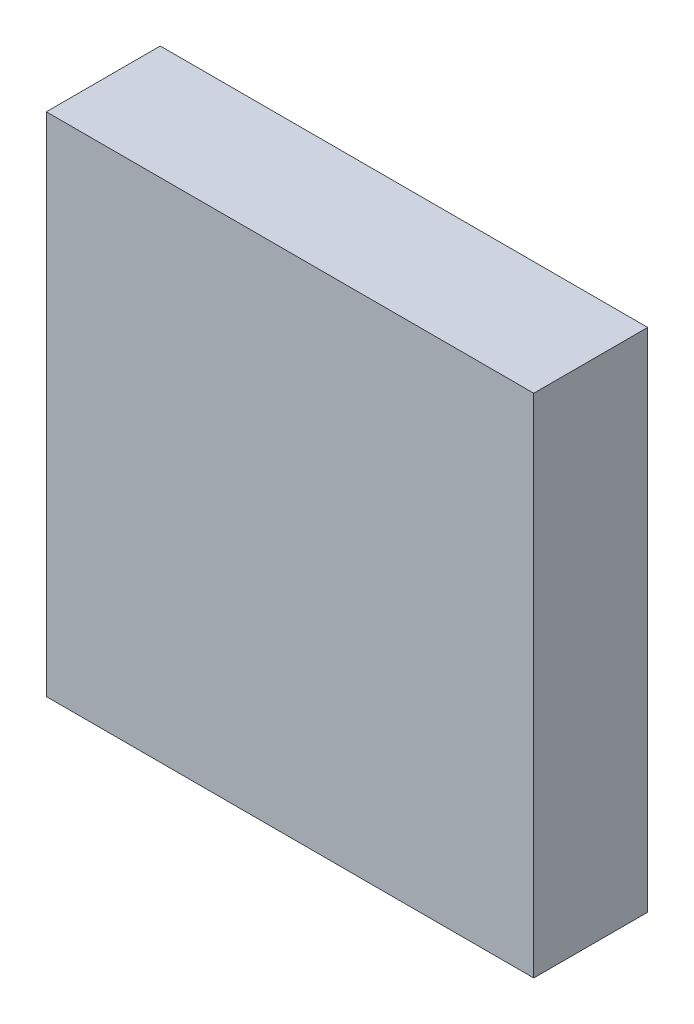
ISO-10303-21;
HEADER;
FILE_DESCRIPTION(('STEP AP214'),'2;1');
FILE_NAME('part.step','',(''),(''),'','','');
FILE_SCHEMA(('AUTOMOTIVE_DESIGN { 1 0 10303 214 1 1 1 1 }'));
ENDSEC;
DATA;
#1=APPLICATION_CONTEXT('core data for automotive mechanical design processes');
#2=APPLICATION_PROTOCOL_DEFINITION('international standard','automotive_design',2000,#1);
#3=PRODUCT_CONTEXT('',#1,'mechanical');
#4=PRODUCT('Part','Part','',(#3));
#5=PRODUCT_RELATED_PRODUCT_CATEGORY('part','',(#4));
#6=PRODUCT_DEFINITION_FORMATION('','',#4);
#7=PRODUCT_DEFINITION_CONTEXT('part definition',#1,'design');
#8=PRODUCT_DEFINITION('design','',#6,#7);
#9=PRODUCT_DEFINITION_SHAPE('','',#8);
#10=(LENGTH_UNIT() NAMED_UNIT(*) SI_UNIT(.MILLI.,.METRE.));
#11=(NAMED_UNIT(*) PLANE_ANGLE_UNIT() SI_UNIT($,.RADIAN.));
#12=(NAMED_UNIT(*) SI_UNIT($,.STERADIAN.) SOLID_ANGLE_UNIT());
#13=UNCERTAINTY_MEASURE_WITH_UNIT(LENGTH_MEASURE(1.E-05),#10,'distance_accuracy_value','');
#14=(GEOMETRIC_REPRESENTATION_CONTEXT(3) GLOBAL_UNCERTAINTY_ASSIGNED_CONTEXT((#13)) GLOBAL_UNIT_ASSIGNED_CONTEXT((#10,
#11,#12)) REPRESENTATION_CONTEXT('',''));
#15=CARTESIAN_POINT('',(0.,0.,0.));
#16=DIRECTION('',(0.,0.,1.));
#17=DIRECTION('',(1.,0.,0.));
#18=AXIS2_PLACEMENT_3D('',#15,#16,#17);
#19=CARTESIAN_POINT('',(19.25,-20.,4.5));
#20=DIRECTION('',(-1.,0.,0.));
#21=DIRECTION('',(0.,0.,1.));
#22=AXIS2_PLACEMENT_3D('',#19,#20,#21);
#23=PLANE('',#22);
#24=DIRECTION('',(0.,1.,0.));
#25=VECTOR('',#24,1.);
#26=CARTESIAN_POINT('',(19.25,-20.,-4.5));
#27=LINE('',#26,#25);
#28=CARTESIAN_POINT('',(19.25,-20.,-4.5));
#29=VERTEX_POINT('',#28);
#30=CARTESIAN_POINT('',(19.25,20.,-4.5));
#31=VERTEX_POINT('',#30);
#32=EDGE_CURVE('E100',#29,#31,#27,.T.);
#33=ORIENTED_EDGE('',*,*,#32,.T.);
#34=DIRECTION('',(0.,0.,-1.));
#35=VECTOR('',#34,1.);
#36=CARTESIAN_POINT('',(19.25,20.,4.5));
#37=LINE('',#36,#35);
#38=CARTESIAN_POINT('',(19.25,20.,4.5));
#39=VERTEX_POINT('',#38);
#40=EDGE_CURVE('E11',#39,#31,#37,.T.);
#41=ORIENTED_EDGE('',*,*,#40,.F.);
#42=DIRECTION('',(0.,1.,0.));
#43=VECTOR('',#42,1.);
#44=CARTESIAN_POINT('',(19.25,-20.,4.5));
#45=LINE('',#44,#43);
#46=CARTESIAN_POINT('',(19.25,-20.,4.5));
#47=VERTEX_POINT('',#46);
#48=EDGE_CURVE('E88',#47,#39,#45,.T.);
#49=ORIENTED_EDGE('',*,*,#48,.F.);
#50=DIRECTION('',(0.,0.,-1.));
#51=VECTOR('',#50,1.);
#52=CARTESIAN_POINT('',(19.25,-20.,4.5));
#53=LINE('',#52,#51);
#54=EDGE_CURVE('E96',#47,#29,#53,.T.);
#55=ORIENTED_EDGE('',*,*,#54,.T.);
#56=EDGE_LOOP('',(#33,#41,#49,#55));
#57=FACE_BOUND('',#56,.T.);
#58=ADVANCED_FACE('F37',(#57),#23,.F.);
#59=CARTESIAN_POINT('',(-19.25,20.,4.5));
#60=DIRECTION('',(0.,-1.,0.));
#61=DIRECTION('',(0.,0.,-1.));
#62=AXIS2_PLACEMENT_3D('',#59,#60,#61);
#63=PLANE('',#62);
#64=DIRECTION('',(-1.,0.,0.));
#65=VECTOR('',#64,1.);
#66=CARTESIAN_POINT('',(-19.25,20.,-4.5));
#67=LINE('',#66,#65);
#68=CARTESIAN_POINT('',(-19.25,20.,-4.5));
#69=VERTEX_POINT('',#68);
#70=EDGE_CURVE('E92',#31,#69,#67,.T.);
#71=ORIENTED_EDGE('',*,*,#70,.T.);
#72=DIRECTION('',(0.,0.,-1.));
#73=VECTOR('',#72,1.);
#74=CARTESIAN_POINT('',(-19.25,20.,4.5));
#75=LINE('',#74,#73);
#76=CARTESIAN_POINT('',(-19.25,20.,4.5));
#77=VERTEX_POINT('',#76);
#78=EDGE_CURVE('E45',#77,#69,#75,.T.);
#79=ORIENTED_EDGE('',*,*,#78,.F.);
#80=DIRECTION('',(-1.,0.,0.));
#81=VECTOR('',#80,1.);
#82=CARTESIAN_POINT('',(-19.25,20.,4.5));
#83=LINE('',#82,#81);
#84=EDGE_CURVE('E83',#39,#77,#83,.T.);
#85=ORIENTED_EDGE('',*,*,#84,.F.);
#86=ORIENTED_EDGE('',*,*,#40,.T.);
#87=EDGE_LOOP('',(#71,#79,#85,#86));
#88=FACE_BOUND('',#87,.T.);
#89=ADVANCED_FACE('F91',(#88),#63,.F.);
#90=CARTESIAN_POINT('',(-19.25,-20.,4.5));
#91=DIRECTION('',(1.,0.,0.));
#92=DIRECTION('',(0.,0.,-1.));
#93=AXIS2_PLACEMENT_3D('',#90,#91,#92);
#94=PLANE('',#93);
#95=DIRECTION('',(0.,-1.,0.));
#96=VECTOR('',#95,1.);
#97=CARTESIAN_POINT('',(-19.25,-20.,-4.5));
#98=LINE('',#97,#96);
#99=CARTESIAN_POINT('',(-19.25,-20.,-4.5));
#100=VERTEX_POINT('',#99);
#101=EDGE_CURVE('E70',#69,#100,#98,.T.);
#102=ORIENTED_EDGE('',*,*,#101,.T.);
#103=DIRECTION('',(0.,0.,-1.));
#104=VECTOR('',#103,1.);
#105=CARTESIAN_POINT('',(-19.25,-20.,4.5));
#106=LINE('',#105,#104);
#107=CARTESIAN_POINT('',(-19.25,-20.,4.5));
#108=VERTEX_POINT('',#107);
#109=EDGE_CURVE('E93',#108,#100,#106,.T.);
#110=ORIENTED_EDGE('',*,*,#109,.F.);
#111=DIRECTION('',(0.,-1.,0.));
#112=VECTOR('',#111,1.);
#113=CARTESIAN_POINT('',(-19.25,-20.,4.5));
#114=LINE('',#113,#112);
#115=EDGE_CURVE('E86',#77,#108,#114,.T.);
#116=ORIENTED_EDGE('',*,*,#115,.F.);
#117=ORIENTED_EDGE('',*,*,#78,.T.);
#118=EDGE_LOOP('',(#102,#110,#116,#117));
#119=FACE_BOUND('',#118,.T.);
#120=ADVANCED_FACE('F94',(#119),#94,.F.);
#121=CARTESIAN_POINT('',(-19.25,-20.,4.5));
#122=DIRECTION('',(0.,1.,0.));
#123=DIRECTION('',(0.,0.,1.));
#124=AXIS2_PLACEMENT_3D('',#121,#122,#123);
#125=PLANE('',#124);
#126=DIRECTION('',(1.,0.,0.));
#127=VECTOR('',#126,1.);
#128=CARTESIAN_POINT('',(-19.25,-20.,-4.5));
#129=LINE('',#128,#127);
#130=EDGE_CURVE('E76',#100,#29,#129,.T.);
#131=ORIENTED_EDGE('',*,*,#130,.T.);
#132=ORIENTED_EDGE('',*,*,#54,.F.);
#133=DIRECTION('',(1.,0.,0.));
#134=VECTOR('',#133,1.);
#135=CARTESIAN_POINT('',(-19.25,-20.,4.5));
#136=LINE('',#135,#134);
#137=EDGE_CURVE('E53',#108,#47,#136,.T.);
#138=ORIENTED_EDGE('',*,*,#137,.F.);
#139=ORIENTED_EDGE('',*,*,#109,.T.);
#140=EDGE_LOOP('',(#131,#132,#138,#139));
#141=FACE_BOUND('',#140,.T.);
#142=ADVANCED_FACE('F107',(#141),#125,.F.);
#143=CARTESIAN_POINT('',(0.,0.,4.5));
#144=DIRECTION('',(0.,0.,-1.));
#145=DIRECTION('',(-1.,0.,0.));
#146=AXIS2_PLACEMENT_3D('',#143,#144,#145);
#147=PLANE('',#146);
#148=ORIENTED_EDGE('',*,*,#48,.T.);
#149=ORIENTED_EDGE('',*,*,#84,.T.);
#150=ORIENTED_EDGE('',*,*,#115,.T.);
#151=ORIENTED_EDGE('',*,*,#137,.T.);
#152=EDGE_LOOP('',(#148,#149,#150,#151));
#153=FACE_BOUND('',#152,.T.);
#154=ADVANCED_FACE('F84',(#153),#147,.F.);
#155=CARTESIAN_POINT('',(0.,0.,-4.5));
#156=DIRECTION('',(0.,0.,-1.));
#157=DIRECTION('',(-1.,0.,0.));
#158=AXIS2_PLACEMENT_3D('',#155,#156,#157);
#159=PLANE('',#158);
#160=ORIENTED_EDGE('',*,*,#32,.F.);
#161=ORIENTED_EDGE('',*,*,#130,.F.);
#162=ORIENTED_EDGE('',*,*,#101,.F.);
#163=ORIENTED_EDGE('',*,*,#70,.F.);
#164=EDGE_LOOP('',(#160,#161,#162,#163));
#165=FACE_BOUND('',#164,.T.);
#166=ADVANCED_FACE('F110',(#165),#159,.T.);
#167=CLOSED_SHELL('',(#58,#89,#120,#142,#154,#166));
#168=MANIFOLD_SOLID_BREP('B2',#167);
#169=ADVANCED_BREP_SHAPE_REPRESENTATION('',(#18,#168),#14);
#170=SHAPE_DEFINITION_REPRESENTATION(#9,#169);
ENDSEC;
END-ISO-10303-21;
